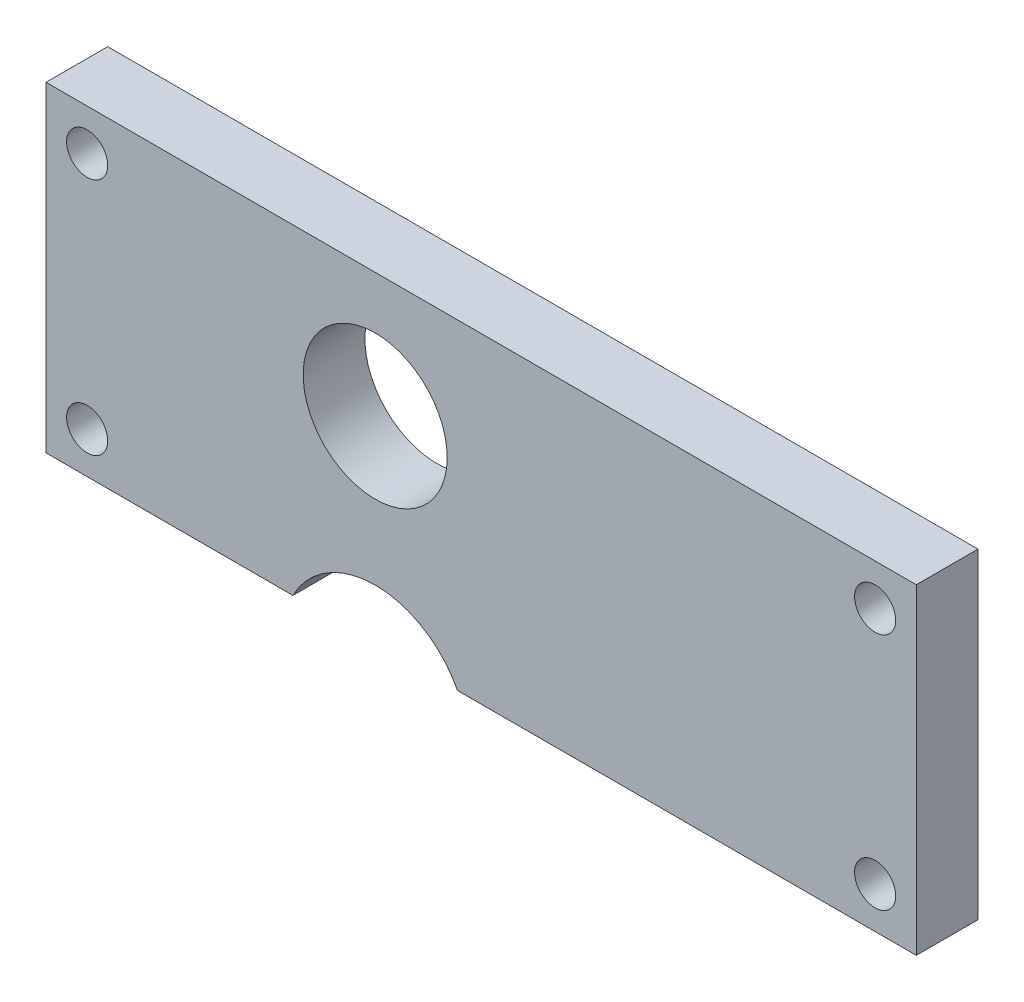
ISO-10303-21;
HEADER;
FILE_DESCRIPTION(('STEP AP214'),'2;1');
FILE_NAME('part.step','',(''),(''),'','','');
FILE_SCHEMA(('AUTOMOTIVE_DESIGN { 1 0 10303 214 1 1 1 1 }'));
ENDSEC;
DATA;
#1=APPLICATION_CONTEXT('core data for automotive mechanical design processes');
#2=APPLICATION_PROTOCOL_DEFINITION('international standard','automotive_design',2000,#1);
#3=PRODUCT_CONTEXT('',#1,'mechanical');
#4=PRODUCT('Part','Part','',(#3));
#5=PRODUCT_RELATED_PRODUCT_CATEGORY('part','',(#4));
#6=PRODUCT_DEFINITION_FORMATION('','',#4);
#7=PRODUCT_DEFINITION_CONTEXT('part definition',#1,'design');
#8=PRODUCT_DEFINITION('design','',#6,#7);
#9=PRODUCT_DEFINITION_SHAPE('','',#8);
#10=(LENGTH_UNIT() NAMED_UNIT(*) SI_UNIT(.MILLI.,.METRE.));
#11=(NAMED_UNIT(*) PLANE_ANGLE_UNIT() SI_UNIT($,.RADIAN.));
#12=(NAMED_UNIT(*) SI_UNIT($,.STERADIAN.) SOLID_ANGLE_UNIT());
#13=UNCERTAINTY_MEASURE_WITH_UNIT(LENGTH_MEASURE(1.E-05),#10,'distance_accuracy_value','');
#14=(GEOMETRIC_REPRESENTATION_CONTEXT(3) GLOBAL_UNCERTAINTY_ASSIGNED_CONTEXT((#13)) GLOBAL_UNIT_ASSIGNED_CONTEXT((#10,
#11,#12)) REPRESENTATION_CONTEXT('',''));
#15=CARTESIAN_POINT('',(0.,0.,0.));
#16=DIRECTION('',(0.,0.,1.));
#17=DIRECTION('',(1.,0.,0.));
#18=AXIS2_PLACEMENT_3D('',#15,#16,#17);
#19=CARTESIAN_POINT('',(0.,0.,3.));
#20=DIRECTION('',(0.,1.,0.));
#21=DIRECTION('',(0.,0.,1.));
#22=AXIS2_PLACEMENT_3D('',#19,#20,#21);
#23=PLANE('',#22);
#24=DIRECTION('',(1.,0.,0.));
#25=VECTOR('',#24,1.);
#26=CARTESIAN_POINT('',(0.,0.,0.));
#27=LINE('',#26,#25);
#28=CARTESIAN_POINT('',(0.,0.,0.));
#29=VERTEX_POINT('',#28);
#30=CARTESIAN_POINT('',(12.,0.,0.));
#31=VERTEX_POINT('',#30);
#32=EDGE_CURVE('E124',#29,#31,#27,.T.);
#33=ORIENTED_EDGE('',*,*,#32,.T.);
#34=DIRECTION('',(0.,0.,1.));
#35=VECTOR('',#34,1.);
#36=CARTESIAN_POINT('',(12.,0.,0.));
#37=LINE('',#36,#35);
#38=CARTESIAN_POINT('',(12.,0.,3.));
#39=VERTEX_POINT('',#38);
#40=EDGE_CURVE('E54',#31,#39,#37,.T.);
#41=ORIENTED_EDGE('',*,*,#40,.T.);
#42=DIRECTION('',(1.,0.,0.));
#43=VECTOR('',#42,1.);
#44=CARTESIAN_POINT('',(0.,0.,3.));
#45=LINE('',#44,#43);
#46=CARTESIAN_POINT('',(0.,0.,3.));
#47=VERTEX_POINT('',#46);
#48=EDGE_CURVE('E90',#47,#39,#45,.T.);
#49=ORIENTED_EDGE('',*,*,#48,.F.);
#50=DIRECTION('',(0.,0.,-1.));
#51=VECTOR('',#50,1.);
#52=CARTESIAN_POINT('',(0.,0.,3.));
#53=LINE('',#52,#51);
#54=EDGE_CURVE('E11',#47,#29,#53,.T.);
#55=ORIENTED_EDGE('',*,*,#54,.T.);
#56=EDGE_LOOP('',(#33,#41,#49,#55));
#57=FACE_BOUND('',#56,.T.);
#58=ADVANCED_FACE('F38',(#57),#23,.F.);
#59=CARTESIAN_POINT('',(0.,0.,3.));
#60=DIRECTION('',(1.,0.,0.));
#61=DIRECTION('',(0.,0.,-1.));
#62=AXIS2_PLACEMENT_3D('',#59,#60,#61);
#63=PLANE('',#62);
#64=DIRECTION('',(0.,-1.,0.));
#65=VECTOR('',#64,1.);
#66=CARTESIAN_POINT('',(0.,0.,0.));
#67=LINE('',#66,#65);
#68=CARTESIAN_POINT('',(0.,15.6,0.));
#69=VERTEX_POINT('',#68);
#70=EDGE_CURVE('E125',#69,#29,#67,.T.);
#71=ORIENTED_EDGE('',*,*,#70,.T.);
#72=ORIENTED_EDGE('',*,*,#54,.F.);
#73=DIRECTION('',(0.,-1.,0.));
#74=VECTOR('',#73,1.);
#75=CARTESIAN_POINT('',(0.,0.,3.));
#76=LINE('',#75,#74);
#77=CARTESIAN_POINT('',(0.,15.6,3.));
#78=VERTEX_POINT('',#77);
#79=EDGE_CURVE('E138',#78,#47,#76,.T.);
#80=ORIENTED_EDGE('',*,*,#79,.F.);
#81=DIRECTION('',(0.,0.,-1.));
#82=VECTOR('',#81,1.);
#83=CARTESIAN_POINT('',(0.,15.6,3.));
#84=LINE('',#83,#82);
#85=EDGE_CURVE('E139',#78,#69,#84,.T.);
#86=ORIENTED_EDGE('',*,*,#85,.T.);
#87=EDGE_LOOP('',(#71,#72,#80,#86));
#88=FACE_BOUND('',#87,.T.);
#89=ADVANCED_FACE('F40',(#88),#63,.F.);
#90=CARTESIAN_POINT('',(20.,0.,3.));
#91=VERTEX_POINT('',#90);
#92=CARTESIAN_POINT('',(42.3,0.,3.));
#93=VERTEX_POINT('',#92);
#94=EDGE_CURVE('E115',#91,#93,#45,.T.);
#95=ORIENTED_EDGE('',*,*,#94,.F.);
#96=DIRECTION('',(0.,0.,1.));
#97=VECTOR('',#96,1.);
#98=CARTESIAN_POINT('',(20.,0.,0.));
#99=LINE('',#98,#97);
#100=CARTESIAN_POINT('',(20.,0.,0.));
#101=VERTEX_POINT('',#100);
#102=EDGE_CURVE('E101',#101,#91,#99,.T.);
#103=ORIENTED_EDGE('',*,*,#102,.F.);
#104=CARTESIAN_POINT('',(42.3,0.,0.));
#105=VERTEX_POINT('',#104);
#106=EDGE_CURVE('E113',#101,#105,#27,.T.);
#107=ORIENTED_EDGE('',*,*,#106,.T.);
#108=DIRECTION('',(0.,0.,-1.));
#109=VECTOR('',#108,1.);
#110=CARTESIAN_POINT('',(42.3,0.,3.));
#111=LINE('',#110,#109);
#112=EDGE_CURVE('E47',#93,#105,#111,.T.);
#113=ORIENTED_EDGE('',*,*,#112,.F.);
#114=EDGE_LOOP('',(#95,#103,#107,#113));
#115=FACE_BOUND('',#114,.T.);
#116=ADVANCED_FACE('F111',(#115),#23,.F.);
#117=CARTESIAN_POINT('',(42.3,0.,3.));
#118=DIRECTION('',(-1.,0.,0.));
#119=DIRECTION('',(0.,0.,1.));
#120=AXIS2_PLACEMENT_3D('',#117,#118,#119);
#121=PLANE('',#120);
#122=DIRECTION('',(0.,1.,0.));
#123=VECTOR('',#122,1.);
#124=CARTESIAN_POINT('',(42.3,0.,0.));
#125=LINE('',#124,#123);
#126=CARTESIAN_POINT('',(42.3,15.6,0.));
#127=VERTEX_POINT('',#126);
#128=EDGE_CURVE('E122',#105,#127,#125,.T.);
#129=ORIENTED_EDGE('',*,*,#128,.T.);
#130=DIRECTION('',(0.,0.,-1.));
#131=VECTOR('',#130,1.);
#132=CARTESIAN_POINT('',(42.3,15.6,3.));
#133=LINE('',#132,#131);
#134=CARTESIAN_POINT('',(42.3,15.6,3.));
#135=VERTEX_POINT('',#134);
#136=EDGE_CURVE('E142',#135,#127,#133,.T.);
#137=ORIENTED_EDGE('',*,*,#136,.F.);
#138=DIRECTION('',(0.,1.,0.));
#139=VECTOR('',#138,1.);
#140=CARTESIAN_POINT('',(42.3,0.,3.));
#141=LINE('',#140,#139);
#142=EDGE_CURVE('E149',#93,#135,#141,.T.);
#143=ORIENTED_EDGE('',*,*,#142,.F.);
#144=ORIENTED_EDGE('',*,*,#112,.T.);
#145=EDGE_LOOP('',(#129,#137,#143,#144));
#146=FACE_BOUND('',#145,.T.);
#147=ADVANCED_FACE('F147',(#146),#121,.F.);
#148=CARTESIAN_POINT('',(0.,15.6,3.));
#149=DIRECTION('',(0.,-1.,0.));
#150=DIRECTION('',(1.,0.,0.));
#151=AXIS2_PLACEMENT_3D('',#148,#149,#150);
#152=PLANE('',#151);
#153=DIRECTION('',(-1.,0.,0.));
#154=VECTOR('',#153,1.);
#155=CARTESIAN_POINT('',(0.,15.6,0.));
#156=LINE('',#155,#154);
#157=EDGE_CURVE('E84',#127,#69,#156,.T.);
#158=ORIENTED_EDGE('',*,*,#157,.T.);
#159=ORIENTED_EDGE('',*,*,#85,.F.);
#160=DIRECTION('',(-1.,0.,0.));
#161=VECTOR('',#160,1.);
#162=CARTESIAN_POINT('',(0.,15.6,3.));
#163=LINE('',#162,#161);
#164=EDGE_CURVE('E63',#135,#78,#163,.T.);
#165=ORIENTED_EDGE('',*,*,#164,.F.);
#166=ORIENTED_EDGE('',*,*,#136,.T.);
#167=EDGE_LOOP('',(#158,#159,#165,#166));
#168=FACE_BOUND('',#167,.T.);
#169=ADVANCED_FACE('F204',(#168),#152,.F.);
#170=CARTESIAN_POINT('',(0.,0.,3.));
#171=DIRECTION('',(0.,0.,-1.));
#172=DIRECTION('',(-1.,0.,0.));
#173=AXIS2_PLACEMENT_3D('',#170,#171,#172);
#174=PLANE('',#173);
#175=CARTESIAN_POINT('',(16.,9.55,3.));
#176=DIRECTION('',(0.,0.,1.));
#177=DIRECTION('',(1.,0.,0.));
#178=AXIS2_PLACEMENT_3D('',#175,#176,#177);
#179=CIRCLE('',#178,3.5);
#180=CARTESIAN_POINT('',(19.5,9.55,3.));
#181=VERTEX_POINT('',#180);
#182=EDGE_CURVE('E117',#181,#181,#179,.T.);
#183=ORIENTED_EDGE('',*,*,#182,.F.);
#184=EDGE_LOOP('',(#183));
#185=FACE_BOUND('',#184,.T.);
#186=CARTESIAN_POINT('',(2.,13.6,3.));
#187=DIRECTION('',(0.,0.,1.));
#188=DIRECTION('',(1.,0.,0.));
#189=AXIS2_PLACEMENT_3D('',#186,#187,#188);
#190=CIRCLE('',#189,1.);
#191=CARTESIAN_POINT('',(3.,13.6,3.));
#192=VERTEX_POINT('',#191);
#193=EDGE_CURVE('E175',#192,#192,#190,.T.);
#194=ORIENTED_EDGE('',*,*,#193,.F.);
#195=EDGE_LOOP('',(#194));
#196=FACE_BOUND('',#195,.T.);
#197=CARTESIAN_POINT('',(40.3,2.00000000000001,3.));
#198=DIRECTION('',(0.,0.,1.));
#199=DIRECTION('',(1.,0.,0.));
#200=AXIS2_PLACEMENT_3D('',#197,#198,#199);
#201=CIRCLE('',#200,0.999999999999998);
#202=CARTESIAN_POINT('',(41.3,2.00000000000001,3.));
#203=VERTEX_POINT('',#202);
#204=EDGE_CURVE('E166',#203,#203,#201,.T.);
#205=ORIENTED_EDGE('',*,*,#204,.F.);
#206=EDGE_LOOP('',(#205));
#207=FACE_BOUND('',#206,.T.);
#208=CARTESIAN_POINT('',(2.00000000000001,2.,3.));
#209=DIRECTION('',(0.,0.,1.));
#210=DIRECTION('',(1.,0.,0.));
#211=AXIS2_PLACEMENT_3D('',#208,#209,#210);
#212=CIRCLE('',#211,1.);
#213=CARTESIAN_POINT('',(3.00000000000001,2.,3.));
#214=VERTEX_POINT('',#213);
#215=EDGE_CURVE('E182',#214,#214,#212,.T.);
#216=ORIENTED_EDGE('',*,*,#215,.F.);
#217=EDGE_LOOP('',(#216));
#218=FACE_BOUND('',#217,.T.);
#219=CARTESIAN_POINT('',(40.3,13.6,3.));
#220=DIRECTION('',(0.,0.,1.));
#221=DIRECTION('',(1.,0.,0.));
#222=AXIS2_PLACEMENT_3D('',#219,#220,#221);
#223=CIRCLE('',#222,0.999999999999998);
#224=CARTESIAN_POINT('',(41.3,13.6,3.));
#225=VERTEX_POINT('',#224);
#226=EDGE_CURVE('E158',#225,#225,#223,.T.);
#227=ORIENTED_EDGE('',*,*,#226,.F.);
#228=EDGE_LOOP('',(#227));
#229=FACE_BOUND('',#228,.T.);
#230=ORIENTED_EDGE('',*,*,#48,.T.);
#231=CARTESIAN_POINT('',(16.,-2.06155281280883,3.));
#232=DIRECTION('',(0.,0.,1.));
#233=DIRECTION('',(-1.,0.,0.));
#234=AXIS2_PLACEMENT_3D('',#231,#232,#233);
#235=CIRCLE('',#234,4.5);
#236=EDGE_CURVE('E107',#91,#39,#235,.T.);
#237=ORIENTED_EDGE('',*,*,#236,.F.);
#238=ORIENTED_EDGE('',*,*,#94,.T.);
#239=ORIENTED_EDGE('',*,*,#142,.T.);
#240=ORIENTED_EDGE('',*,*,#164,.T.);
#241=ORIENTED_EDGE('',*,*,#79,.T.);
#242=EDGE_LOOP('',(#230,#237,#238,#239,#240,#241));
#243=FACE_BOUND('',#242,.T.);
#244=ADVANCED_FACE('F199',(#185,#196,#207,#218,#229,#243),#174,.F.);
#245=CARTESIAN_POINT('',(0.,0.,0.));
#246=DIRECTION('',(0.,0.,-1.));
#247=DIRECTION('',(-1.,0.,0.));
#248=AXIS2_PLACEMENT_3D('',#245,#246,#247);
#249=PLANE('',#248);
#250=CARTESIAN_POINT('',(16.,-2.06155281280883,0.));
#251=DIRECTION('',(0.,0.,1.));
#252=DIRECTION('',(-1.,0.,0.));
#253=AXIS2_PLACEMENT_3D('',#250,#251,#252);
#254=CIRCLE('',#253,4.5);
#255=EDGE_CURVE('E98',#101,#31,#254,.T.);
#256=ORIENTED_EDGE('',*,*,#255,.T.);
#257=ORIENTED_EDGE('',*,*,#32,.F.);
#258=ORIENTED_EDGE('',*,*,#70,.F.);
#259=ORIENTED_EDGE('',*,*,#157,.F.);
#260=ORIENTED_EDGE('',*,*,#128,.F.);
#261=ORIENTED_EDGE('',*,*,#106,.F.);
#262=EDGE_LOOP('',(#256,#257,#258,#259,#260,#261));
#263=FACE_BOUND('',#262,.T.);
#264=CARTESIAN_POINT('',(16.,9.55,0.));
#265=DIRECTION('',(0.,0.,1.));
#266=DIRECTION('',(1.,0.,0.));
#267=AXIS2_PLACEMENT_3D('',#264,#265,#266);
#268=CIRCLE('',#267,3.5);
#269=CARTESIAN_POINT('',(19.5,9.55,0.));
#270=VERTEX_POINT('',#269);
#271=EDGE_CURVE('E186',#270,#270,#268,.T.);
#272=ORIENTED_EDGE('',*,*,#271,.T.);
#273=EDGE_LOOP('',(#272));
#274=FACE_BOUND('',#273,.T.);
#275=CARTESIAN_POINT('',(2.,13.6,0.));
#276=DIRECTION('',(0.,0.,1.));
#277=DIRECTION('',(1.,0.,0.));
#278=AXIS2_PLACEMENT_3D('',#275,#276,#277);
#279=CIRCLE('',#278,1.);
#280=CARTESIAN_POINT('',(3.,13.6,0.));
#281=VERTEX_POINT('',#280);
#282=EDGE_CURVE('E162',#281,#281,#279,.T.);
#283=ORIENTED_EDGE('',*,*,#282,.T.);
#284=EDGE_LOOP('',(#283));
#285=FACE_BOUND('',#284,.T.);
#286=CARTESIAN_POINT('',(40.3,2.00000000000001,0.));
#287=DIRECTION('',(0.,0.,1.));
#288=DIRECTION('',(1.,0.,0.));
#289=AXIS2_PLACEMENT_3D('',#286,#287,#288);
#290=CIRCLE('',#289,0.999999999999998);
#291=CARTESIAN_POINT('',(41.3,2.00000000000001,0.));
#292=VERTEX_POINT('',#291);
#293=EDGE_CURVE('E170',#292,#292,#290,.T.);
#294=ORIENTED_EDGE('',*,*,#293,.T.);
#295=EDGE_LOOP('',(#294));
#296=FACE_BOUND('',#295,.T.);
#297=CARTESIAN_POINT('',(2.00000000000001,2.,0.));
#298=DIRECTION('',(0.,0.,1.));
#299=DIRECTION('',(1.,0.,0.));
#300=AXIS2_PLACEMENT_3D('',#297,#298,#299);
#301=CIRCLE('',#300,1.);
#302=CARTESIAN_POINT('',(3.00000000000001,2.,0.));
#303=VERTEX_POINT('',#302);
#304=EDGE_CURVE('E171',#303,#303,#301,.T.);
#305=ORIENTED_EDGE('',*,*,#304,.T.);
#306=EDGE_LOOP('',(#305));
#307=FACE_BOUND('',#306,.T.);
#308=CARTESIAN_POINT('',(40.3,13.6,0.));
#309=DIRECTION('',(0.,0.,1.));
#310=DIRECTION('',(1.,0.,0.));
#311=AXIS2_PLACEMENT_3D('',#308,#309,#310);
#312=CIRCLE('',#311,0.999999999999998);
#313=CARTESIAN_POINT('',(41.3,13.6,0.));
#314=VERTEX_POINT('',#313);
#315=EDGE_CURVE('E130',#314,#314,#312,.T.);
#316=ORIENTED_EDGE('',*,*,#315,.T.);
#317=EDGE_LOOP('',(#316));
#318=FACE_BOUND('',#317,.T.);
#319=ADVANCED_FACE('F120',(#263,#274,#285,#296,#307,#318),#249,.T.);
#320=CARTESIAN_POINT('',(40.3,13.6,0.));
#321=DIRECTION('',(0.,0.,1.));
#322=DIRECTION('',(1.,0.,0.));
#323=AXIS2_PLACEMENT_3D('',#320,#321,#322);
#324=CYLINDRICAL_SURFACE('',#323,0.999999999999998);
#325=ORIENTED_EDGE('',*,*,#315,.F.);
#326=EDGE_LOOP('',(#325));
#327=FACE_BOUND('',#326,.T.);
#328=ORIENTED_EDGE('',*,*,#226,.T.);
#329=EDGE_LOOP('',(#328));
#330=FACE_BOUND('',#329,.T.);
#331=ADVANCED_FACE('F241',(#327,#330),#324,.F.);
#332=CARTESIAN_POINT('',(2.00000000000001,2.,0.));
#333=DIRECTION('',(0.,0.,1.));
#334=DIRECTION('',(1.,0.,0.));
#335=AXIS2_PLACEMENT_3D('',#332,#333,#334);
#336=CYLINDRICAL_SURFACE('',#335,1.);
#337=ORIENTED_EDGE('',*,*,#304,.F.);
#338=EDGE_LOOP('',(#337));
#339=FACE_BOUND('',#338,.T.);
#340=ORIENTED_EDGE('',*,*,#215,.T.);
#341=EDGE_LOOP('',(#340));
#342=FACE_BOUND('',#341,.T.);
#343=ADVANCED_FACE('F246',(#339,#342),#336,.F.);
#344=CARTESIAN_POINT('',(40.3,2.00000000000001,0.));
#345=DIRECTION('',(0.,0.,1.));
#346=DIRECTION('',(1.,0.,0.));
#347=AXIS2_PLACEMENT_3D('',#344,#345,#346);
#348=CYLINDRICAL_SURFACE('',#347,0.999999999999998);
#349=ORIENTED_EDGE('',*,*,#293,.F.);
#350=EDGE_LOOP('',(#349));
#351=FACE_BOUND('',#350,.T.);
#352=ORIENTED_EDGE('',*,*,#204,.T.);
#353=EDGE_LOOP('',(#352));
#354=FACE_BOUND('',#353,.T.);
#355=ADVANCED_FACE('F258',(#351,#354),#348,.F.);
#356=CARTESIAN_POINT('',(2.,13.6,0.));
#357=DIRECTION('',(0.,0.,1.));
#358=DIRECTION('',(1.,0.,0.));
#359=AXIS2_PLACEMENT_3D('',#356,#357,#358);
#360=CYLINDRICAL_SURFACE('',#359,1.);
#361=ORIENTED_EDGE('',*,*,#282,.F.);
#362=EDGE_LOOP('',(#361));
#363=FACE_BOUND('',#362,.T.);
#364=ORIENTED_EDGE('',*,*,#193,.T.);
#365=EDGE_LOOP('',(#364));
#366=FACE_BOUND('',#365,.T.);
#367=ADVANCED_FACE('F268',(#363,#366),#360,.F.);
#368=CARTESIAN_POINT('',(16.,9.55,0.));
#369=DIRECTION('',(0.,0.,1.));
#370=DIRECTION('',(1.,0.,0.));
#371=AXIS2_PLACEMENT_3D('',#368,#369,#370);
#372=CYLINDRICAL_SURFACE('',#371,3.5);
#373=ORIENTED_EDGE('',*,*,#271,.F.);
#374=EDGE_LOOP('',(#373));
#375=FACE_BOUND('',#374,.T.);
#376=ORIENTED_EDGE('',*,*,#182,.T.);
#377=EDGE_LOOP('',(#376));
#378=FACE_BOUND('',#377,.T.);
#379=ADVANCED_FACE('F278',(#375,#378),#372,.F.);
#380=CARTESIAN_POINT('',(16.,-2.06155281280883,0.));
#381=DIRECTION('',(0.,0.,1.));
#382=DIRECTION('',(1.,0.,0.));
#383=AXIS2_PLACEMENT_3D('',#380,#381,#382);
#384=CYLINDRICAL_SURFACE('',#383,4.5);
#385=ORIENTED_EDGE('',*,*,#236,.T.);
#386=ORIENTED_EDGE('',*,*,#40,.F.);
#387=ORIENTED_EDGE('',*,*,#255,.F.);
#388=ORIENTED_EDGE('',*,*,#102,.T.);
#389=EDGE_LOOP('',(#385,#386,#387,#388));
#390=FACE_BOUND('',#389,.T.);
#391=ADVANCED_FACE('F100',(#390),#384,.F.);
#392=CLOSED_SHELL('',(#58,#89,#116,#147,#169,#244,#319,#331,#343,#355,#367,#379,#391));
#393=MANIFOLD_SOLID_BREP('B2',#392);
#394=ADVANCED_BREP_SHAPE_REPRESENTATION('',(#18,#393),#14);
#395=SHAPE_DEFINITION_REPRESENTATION(#9,#394);
ENDSEC;
END-ISO-10303-21;
